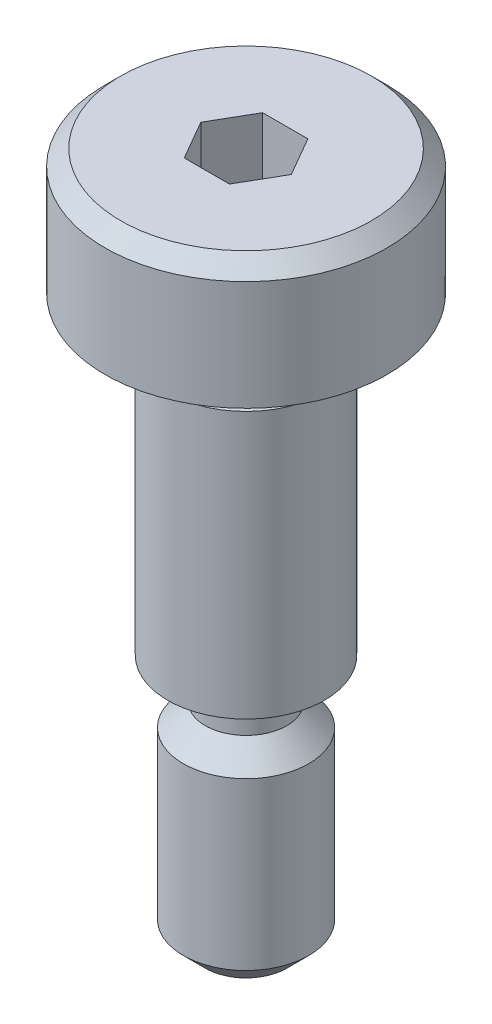
ISO-10303-21;
HEADER;
FILE_DESCRIPTION(('STEP AP214'),'2;1');
FILE_NAME('part.step','',(''),(''),'','','');
FILE_SCHEMA(('AUTOMOTIVE_DESIGN { 1 0 10303 214 1 1 1 1 }'));
ENDSEC;
DATA;
#1=APPLICATION_CONTEXT('core data for automotive mechanical design processes');
#2=APPLICATION_PROTOCOL_DEFINITION('international standard','automotive_design',2000,#1);
#3=PRODUCT_CONTEXT('',#1,'mechanical');
#4=PRODUCT('Part','Part','',(#3));
#5=PRODUCT_RELATED_PRODUCT_CATEGORY('part','',(#4));
#6=PRODUCT_DEFINITION_FORMATION('','',#4);
#7=PRODUCT_DEFINITION_CONTEXT('part definition',#1,'design');
#8=PRODUCT_DEFINITION('design','',#6,#7);
#9=PRODUCT_DEFINITION_SHAPE('','',#8);
#10=(LENGTH_UNIT() NAMED_UNIT(*) SI_UNIT(.MILLI.,.METRE.));
#11=(NAMED_UNIT(*) PLANE_ANGLE_UNIT() SI_UNIT($,.RADIAN.));
#12=(NAMED_UNIT(*) SI_UNIT($,.STERADIAN.) SOLID_ANGLE_UNIT());
#13=UNCERTAINTY_MEASURE_WITH_UNIT(LENGTH_MEASURE(1.E-05),#10,'distance_accuracy_value','');
#14=(GEOMETRIC_REPRESENTATION_CONTEXT(3) GLOBAL_UNCERTAINTY_ASSIGNED_CONTEXT((#13)) GLOBAL_UNIT_ASSIGNED_CONTEXT((#10,
#11,#12)) REPRESENTATION_CONTEXT('',''));
#15=CARTESIAN_POINT('',(0.,0.,0.));
#16=DIRECTION('',(0.,0.,1.));
#17=DIRECTION('',(1.,0.,0.));
#18=AXIS2_PLACEMENT_3D('',#15,#16,#17);
#19=CARTESIAN_POINT('',(1.3,0.,0.));
#20=DIRECTION('',(0.,-1.,0.));
#21=DIRECTION('',(0.,0.,-1.));
#22=AXIS2_PLACEMENT_3D('',#19,#20,#21);
#23=PLANE('',#22);
#24=CARTESIAN_POINT('',(0.,0.,0.));
#25=DIRECTION('',(0.,-1.,0.));
#26=DIRECTION('',(0.,0.,-1.));
#27=AXIS2_PLACEMENT_3D('',#24,#25,#26);
#28=CIRCLE('',#27,1.3);
#29=CARTESIAN_POINT('',(0.,0.,-1.3));
#30=VERTEX_POINT('',#29);
#31=EDGE_CURVE('E11',#30,#30,#28,.T.);
#32=ORIENTED_EDGE('',*,*,#31,.T.);
#33=EDGE_LOOP('',(#32));
#34=FACE_BOUND('',#33,.T.);
#35=ADVANCED_FACE('F34',(#34),#23,.T.);
#36=CARTESIAN_POINT('',(0.,0.,0.));
#37=DIRECTION('',(0.,1.,0.));
#38=DIRECTION('',(0.,0.,1.));
#39=AXIS2_PLACEMENT_3D('',#36,#37,#38);
#40=CONICAL_SURFACE('',#39,1.3,0.78539816339745);
#41=CARTESIAN_POINT('',(0.,0.699999999999998,0.));
#42=DIRECTION('',(0.,-1.,0.));
#43=DIRECTION('',(0.,0.,-1.));
#44=AXIS2_PLACEMENT_3D('',#41,#42,#43);
#45=CIRCLE('',#44,2.);
#46=CARTESIAN_POINT('',(0.,0.699999999999998,-2.));
#47=VERTEX_POINT('',#46);
#48=EDGE_CURVE('E41',#47,#47,#45,.T.);
#49=ORIENTED_EDGE('',*,*,#48,.T.);
#50=EDGE_LOOP('',(#49));
#51=FACE_BOUND('',#50,.T.);
#52=ORIENTED_EDGE('',*,*,#31,.F.);
#53=EDGE_LOOP('',(#52));
#54=FACE_BOUND('',#53,.T.);
#55=ADVANCED_FACE('F178',(#51,#54),#40,.T.);
#56=CARTESIAN_POINT('',(0.,0.,0.));
#57=DIRECTION('',(0.,-1.,0.));
#58=DIRECTION('',(0.,0.,-1.));
#59=AXIS2_PLACEMENT_3D('',#56,#57,#58);
#60=CYLINDRICAL_SURFACE('',#59,2.);
#61=CARTESIAN_POINT('',(0.,6.,0.));
#62=DIRECTION('',(0.,-1.,0.));
#63=DIRECTION('',(0.,0.,-1.));
#64=AXIS2_PLACEMENT_3D('',#61,#62,#63);
#65=CIRCLE('',#64,2.);
#66=CARTESIAN_POINT('',(0.,6.,-2.));
#67=VERTEX_POINT('',#66);
#68=EDGE_CURVE('E173',#67,#67,#65,.T.);
#69=ORIENTED_EDGE('',*,*,#68,.T.);
#70=EDGE_LOOP('',(#69));
#71=FACE_BOUND('',#70,.T.);
#72=ORIENTED_EDGE('',*,*,#48,.F.);
#73=EDGE_LOOP('',(#72));
#74=FACE_BOUND('',#73,.T.);
#75=ADVANCED_FACE('F181',(#71,#74),#60,.T.);
#76=CARTESIAN_POINT('',(0.,6.,0.));
#77=DIRECTION('',(0.,-1.,0.));
#78=DIRECTION('',(0.,0.,-1.));
#79=AXIS2_PLACEMENT_3D('',#76,#77,#78);
#80=CONICAL_SURFACE('',#79,2.,0.785398163397447);
#81=CARTESIAN_POINT('',(0.,6.7,0.));
#82=DIRECTION('',(0.,-1.,0.));
#83=DIRECTION('',(0.,0.,-1.));
#84=AXIS2_PLACEMENT_3D('',#81,#82,#83);
#85=CIRCLE('',#84,1.3);
#86=CARTESIAN_POINT('',(0.,6.7,-1.3));
#87=VERTEX_POINT('',#86);
#88=EDGE_CURVE('E170',#87,#87,#85,.T.);
#89=ORIENTED_EDGE('',*,*,#88,.T.);
#90=EDGE_LOOP('',(#89));
#91=FACE_BOUND('',#90,.T.);
#92=ORIENTED_EDGE('',*,*,#68,.F.);
#93=EDGE_LOOP('',(#92));
#94=FACE_BOUND('',#93,.T.);
#95=ADVANCED_FACE('F183',(#91,#94),#80,.T.);
#96=CARTESIAN_POINT('',(0.,0.,0.));
#97=DIRECTION('',(0.,-1.,0.));
#98=DIRECTION('',(0.,0.,-1.));
#99=AXIS2_PLACEMENT_3D('',#96,#97,#98);
#100=CYLINDRICAL_SURFACE('',#99,1.3);
#101=CARTESIAN_POINT('',(0.,7.3,0.));
#102=DIRECTION('',(0.,-1.,0.));
#103=DIRECTION('',(0.,0.,-1.));
#104=AXIS2_PLACEMENT_3D('',#101,#102,#103);
#105=CIRCLE('',#104,1.3);
#106=CARTESIAN_POINT('',(0.,7.3,-1.3));
#107=VERTEX_POINT('',#106);
#108=EDGE_CURVE('E167',#107,#107,#105,.T.);
#109=ORIENTED_EDGE('',*,*,#108,.T.);
#110=EDGE_LOOP('',(#109));
#111=FACE_BOUND('',#110,.T.);
#112=ORIENTED_EDGE('',*,*,#88,.F.);
#113=EDGE_LOOP('',(#112));
#114=FACE_BOUND('',#113,.T.);
#115=ADVANCED_FACE('F190',(#111,#114),#100,.T.);
#116=CARTESIAN_POINT('',(0.,7.3,0.));
#117=DIRECTION('',(0.,-1.,0.));
#118=DIRECTION('',(0.,0.,-1.));
#119=AXIS2_PLACEMENT_3D('',#116,#117,#118);
#120=TOROIDAL_SURFACE('',#119,2.,0.700000000000001);
#121=CARTESIAN_POINT('',(0.,8.,0.));
#122=DIRECTION('',(0.,-1.,0.));
#123=DIRECTION('',(0.,0.,-1.));
#124=AXIS2_PLACEMENT_3D('',#121,#122,#123);
#125=CIRCLE('',#124,2.);
#126=CARTESIAN_POINT('',(0.,8.,-2.));
#127=VERTEX_POINT('',#126);
#128=EDGE_CURVE('E164',#127,#127,#125,.T.);
#129=ORIENTED_EDGE('',*,*,#128,.T.);
#130=EDGE_LOOP('',(#129));
#131=FACE_BOUND('',#130,.T.);
#132=ORIENTED_EDGE('',*,*,#108,.F.);
#133=EDGE_LOOP('',(#132));
#134=FACE_BOUND('',#133,.T.);
#135=ADVANCED_FACE('F221',(#131,#134),#120,.F.);
#136=CARTESIAN_POINT('',(2.5,8.,0.));
#137=DIRECTION('',(0.,-1.,0.));
#138=DIRECTION('',(0.,0.,-1.));
#139=AXIS2_PLACEMENT_3D('',#136,#137,#138);
#140=PLANE('',#139);
#141=CARTESIAN_POINT('',(0.,8.,0.));
#142=DIRECTION('',(0.,-1.,0.));
#143=DIRECTION('',(0.,0.,-1.));
#144=AXIS2_PLACEMENT_3D('',#141,#142,#143);
#145=CIRCLE('',#144,2.5);
#146=CARTESIAN_POINT('',(0.,8.,-2.5));
#147=VERTEX_POINT('',#146);
#148=EDGE_CURVE('E161',#147,#147,#145,.T.);
#149=ORIENTED_EDGE('',*,*,#148,.T.);
#150=EDGE_LOOP('',(#149));
#151=FACE_BOUND('',#150,.T.);
#152=ORIENTED_EDGE('',*,*,#128,.F.);
#153=EDGE_LOOP('',(#152));
#154=FACE_BOUND('',#153,.T.);
#155=ADVANCED_FACE('F231',(#151,#154),#140,.T.);
#156=CARTESIAN_POINT('',(0.,0.,0.));
#157=DIRECTION('',(0.,-1.,0.));
#158=DIRECTION('',(0.,0.,-1.));
#159=AXIS2_PLACEMENT_3D('',#156,#157,#158);
#160=CYLINDRICAL_SURFACE('',#159,2.5);
#161=CARTESIAN_POINT('',(0.,16.5,0.));
#162=DIRECTION('',(0.,-1.,0.));
#163=DIRECTION('',(0.,0.,-1.));
#164=AXIS2_PLACEMENT_3D('',#161,#162,#163);
#165=CIRCLE('',#164,2.5);
#166=CARTESIAN_POINT('',(0.,16.5,-2.5));
#167=VERTEX_POINT('',#166);
#168=EDGE_CURVE('E158',#167,#167,#165,.T.);
#169=ORIENTED_EDGE('',*,*,#168,.T.);
#170=EDGE_LOOP('',(#169));
#171=FACE_BOUND('',#170,.T.);
#172=ORIENTED_EDGE('',*,*,#148,.F.);
#173=EDGE_LOOP('',(#172));
#174=FACE_BOUND('',#173,.T.);
#175=ADVANCED_FACE('F241',(#171,#174),#160,.T.);
#176=CARTESIAN_POINT('',(0.,16.5,0.));
#177=DIRECTION('',(0.,-1.,0.));
#178=DIRECTION('',(0.,0.,-1.));
#179=AXIS2_PLACEMENT_3D('',#176,#177,#178);
#180=CONICAL_SURFACE('',#179,2.5,0.785398163397445);
#181=CARTESIAN_POINT('',(0.,17.,0.));
#182=DIRECTION('',(0.,-1.,0.));
#183=DIRECTION('',(0.,0.,-1.));
#184=AXIS2_PLACEMENT_3D('',#181,#182,#183);
#185=CIRCLE('',#184,2.);
#186=CARTESIAN_POINT('',(0.,17.,-2.));
#187=VERTEX_POINT('',#186);
#188=EDGE_CURVE('E155',#187,#187,#185,.T.);
#189=ORIENTED_EDGE('',*,*,#188,.T.);
#190=EDGE_LOOP('',(#189));
#191=FACE_BOUND('',#190,.T.);
#192=ORIENTED_EDGE('',*,*,#168,.F.);
#193=EDGE_LOOP('',(#192));
#194=FACE_BOUND('',#193,.T.);
#195=ADVANCED_FACE('F251',(#191,#194),#180,.T.);
#196=CARTESIAN_POINT('',(0.,0.,0.));
#197=DIRECTION('',(0.,-1.,0.));
#198=DIRECTION('',(0.,0.,-1.));
#199=AXIS2_PLACEMENT_3D('',#196,#197,#198);
#200=CYLINDRICAL_SURFACE('',#199,2.);
#201=CARTESIAN_POINT('',(0.,17.5,0.));
#202=DIRECTION('',(0.,-1.,0.));
#203=DIRECTION('',(0.,0.,-1.));
#204=AXIS2_PLACEMENT_3D('',#201,#202,#203);
#205=CIRCLE('',#204,2.);
#206=CARTESIAN_POINT('',(0.,17.5,-2.));
#207=VERTEX_POINT('',#206);
#208=EDGE_CURVE('E152',#207,#207,#205,.T.);
#209=ORIENTED_EDGE('',*,*,#208,.T.);
#210=EDGE_LOOP('',(#209));
#211=FACE_BOUND('',#210,.T.);
#212=ORIENTED_EDGE('',*,*,#188,.F.);
#213=EDGE_LOOP('',(#212));
#214=FACE_BOUND('',#213,.T.);
#215=ADVANCED_FACE('F261',(#211,#214),#200,.T.);
#216=CARTESIAN_POINT('',(0.,17.5,0.));
#217=DIRECTION('',(0.,-1.,0.));
#218=DIRECTION('',(0.,0.,-1.));
#219=AXIS2_PLACEMENT_3D('',#216,#217,#218);
#220=TOROIDAL_SURFACE('',#219,2.5,0.5);
#221=CARTESIAN_POINT('',(0.,18.,0.));
#222=DIRECTION('',(0.,-1.,0.));
#223=DIRECTION('',(0.,0.,-1.));
#224=AXIS2_PLACEMENT_3D('',#221,#222,#223);
#225=CIRCLE('',#224,2.5);
#226=CARTESIAN_POINT('',(0.,18.,-2.5));
#227=VERTEX_POINT('',#226);
#228=EDGE_CURVE('E149',#227,#227,#225,.T.);
#229=ORIENTED_EDGE('',*,*,#228,.T.);
#230=EDGE_LOOP('',(#229));
#231=FACE_BOUND('',#230,.T.);
#232=ORIENTED_EDGE('',*,*,#208,.F.);
#233=EDGE_LOOP('',(#232));
#234=FACE_BOUND('',#233,.T.);
#235=ADVANCED_FACE('F271',(#231,#234),#220,.F.);
#236=CARTESIAN_POINT('',(4.5,18.,0.));
#237=DIRECTION('',(0.,-1.,0.));
#238=DIRECTION('',(0.,0.,-1.));
#239=AXIS2_PLACEMENT_3D('',#236,#237,#238);
#240=PLANE('',#239);
#241=CARTESIAN_POINT('',(0.,18.,0.));
#242=DIRECTION('',(0.,-1.,0.));
#243=DIRECTION('',(0.,0.,-1.));
#244=AXIS2_PLACEMENT_3D('',#241,#242,#243);
#245=CIRCLE('',#244,4.5);
#246=CARTESIAN_POINT('',(0.,18.,-4.5));
#247=VERTEX_POINT('',#246);
#248=EDGE_CURVE('E146',#247,#247,#245,.T.);
#249=ORIENTED_EDGE('',*,*,#248,.T.);
#250=EDGE_LOOP('',(#249));
#251=FACE_BOUND('',#250,.T.);
#252=ORIENTED_EDGE('',*,*,#228,.F.);
#253=EDGE_LOOP('',(#252));
#254=FACE_BOUND('',#253,.T.);
#255=ADVANCED_FACE('F281',(#251,#254),#240,.T.);
#256=CARTESIAN_POINT('',(0.,0.,0.));
#257=DIRECTION('',(0.,-1.,0.));
#258=DIRECTION('',(0.,0.,-1.));
#259=AXIS2_PLACEMENT_3D('',#256,#257,#258);
#260=CYLINDRICAL_SURFACE('',#259,4.5);
#261=CARTESIAN_POINT('',(0.,21.5,0.));
#262=DIRECTION('',(0.,-1.,0.));
#263=DIRECTION('',(0.,0.,-1.));
#264=AXIS2_PLACEMENT_3D('',#261,#262,#263);
#265=CIRCLE('',#264,4.5);
#266=CARTESIAN_POINT('',(0.,21.5,-4.5));
#267=VERTEX_POINT('',#266);
#268=EDGE_CURVE('E143',#267,#267,#265,.T.);
#269=ORIENTED_EDGE('',*,*,#268,.T.);
#270=EDGE_LOOP('',(#269));
#271=FACE_BOUND('',#270,.T.);
#272=ORIENTED_EDGE('',*,*,#248,.F.);
#273=EDGE_LOOP('',(#272));
#274=FACE_BOUND('',#273,.T.);
#275=ADVANCED_FACE('F291',(#271,#274),#260,.T.);
#276=CARTESIAN_POINT('',(0.,21.5,0.));
#277=DIRECTION('',(0.,-1.,0.));
#278=DIRECTION('',(0.,0.,-1.));
#279=AXIS2_PLACEMENT_3D('',#276,#277,#278);
#280=CONICAL_SURFACE('',#279,4.5,0.785398163397446);
#281=CARTESIAN_POINT('',(0.,22.,0.));
#282=DIRECTION('',(0.,-1.,0.));
#283=DIRECTION('',(0.,0.,-1.));
#284=AXIS2_PLACEMENT_3D('',#281,#282,#283);
#285=CIRCLE('',#284,4.);
#286=CARTESIAN_POINT('',(0.,22.,-4.));
#287=VERTEX_POINT('',#286);
#288=EDGE_CURVE('E135',#287,#287,#285,.T.);
#289=ORIENTED_EDGE('',*,*,#288,.T.);
#290=EDGE_LOOP('',(#289));
#291=FACE_BOUND('',#290,.T.);
#292=ORIENTED_EDGE('',*,*,#268,.F.);
#293=EDGE_LOOP('',(#292));
#294=FACE_BOUND('',#293,.T.);
#295=ADVANCED_FACE('F301',(#291,#294),#280,.T.);
#296=CARTESIAN_POINT('',(0.,22.,0.));
#297=DIRECTION('',(0.,1.,0.));
#298=DIRECTION('',(0.,0.,1.));
#299=AXIS2_PLACEMENT_3D('',#296,#297,#298);
#300=PLANE('',#299);
#301=DIRECTION('',(-0.5,0.,-0.866025403784438));
#302=VECTOR('',#301,1.);
#303=CARTESIAN_POINT('',(1.44337567297406,22.,0.));
#304=LINE('',#303,#302);
#305=CARTESIAN_POINT('',(1.44337567297406,22.,0.));
#306=VERTEX_POINT('',#305);
#307=CARTESIAN_POINT('',(0.721687836487032,22.,-1.25));
#308=VERTEX_POINT('',#307);
#309=EDGE_CURVE('E48',#306,#308,#304,.T.);
#310=ORIENTED_EDGE('',*,*,#309,.F.);
#311=DIRECTION('',(0.5,0.,-0.866025403784438));
#312=VECTOR('',#311,1.);
#313=CARTESIAN_POINT('',(0.721687836487032,22.,1.25));
#314=LINE('',#313,#312);
#315=CARTESIAN_POINT('',(0.721687836487032,22.,1.25));
#316=VERTEX_POINT('',#315);
#317=EDGE_CURVE('E131',#316,#306,#314,.T.);
#318=ORIENTED_EDGE('',*,*,#317,.F.);
#319=DIRECTION('',(1.,0.,0.));
#320=VECTOR('',#319,1.);
#321=CARTESIAN_POINT('',(-0.721687836487032,22.,1.25));
#322=LINE('',#321,#320);
#323=CARTESIAN_POINT('',(-0.721687836487032,22.,1.25));
#324=VERTEX_POINT('',#323);
#325=EDGE_CURVE('E129',#324,#316,#322,.T.);
#326=ORIENTED_EDGE('',*,*,#325,.F.);
#327=DIRECTION('',(0.5,0.,0.866025403784439));
#328=VECTOR('',#327,1.);
#329=CARTESIAN_POINT('',(-1.44337567297406,22.,0.));
#330=LINE('',#329,#328);
#331=CARTESIAN_POINT('',(-1.44337567297406,22.,0.));
#332=VERTEX_POINT('',#331);
#333=EDGE_CURVE('E96',#332,#324,#330,.T.);
#334=ORIENTED_EDGE('',*,*,#333,.F.);
#335=DIRECTION('',(-0.5,0.,0.866025403784439));
#336=VECTOR('',#335,1.);
#337=CARTESIAN_POINT('',(-0.721687836487032,22.,-1.25));
#338=LINE('',#337,#336);
#339=CARTESIAN_POINT('',(-0.721687836487032,22.,-1.25));
#340=VERTEX_POINT('',#339);
#341=EDGE_CURVE('E125',#340,#332,#338,.T.);
#342=ORIENTED_EDGE('',*,*,#341,.F.);
#343=DIRECTION('',(-1.,0.,0.));
#344=VECTOR('',#343,1.);
#345=CARTESIAN_POINT('',(0.721687836487032,22.,-1.25));
#346=LINE('',#345,#344);
#347=EDGE_CURVE('E122',#308,#340,#346,.T.);
#348=ORIENTED_EDGE('',*,*,#347,.F.);
#349=EDGE_LOOP('',(#310,#318,#326,#334,#342,#348));
#350=FACE_BOUND('',#349,.T.);
#351=ORIENTED_EDGE('',*,*,#288,.F.);
#352=EDGE_LOOP('',(#351));
#353=FACE_BOUND('',#352,.T.);
#354=ADVANCED_FACE('F311',(#350,#353),#300,.T.);
#355=CARTESIAN_POINT('',(1.44337567297406,19.,0.));
#356=DIRECTION('',(0.866025403784439,0.,-0.5));
#357=DIRECTION('',(-0.5,0.,-0.866025403784439));
#358=AXIS2_PLACEMENT_3D('',#355,#356,#357);
#359=PLANE('',#358);
#360=ORIENTED_EDGE('',*,*,#309,.T.);
#361=DIRECTION('',(0.,1.,0.));
#362=VECTOR('',#361,1.);
#363=CARTESIAN_POINT('',(0.721687836487032,19.,-1.25));
#364=LINE('',#363,#362);
#365=CARTESIAN_POINT('',(0.721687836487032,19.,-1.25));
#366=VERTEX_POINT('',#365);
#367=EDGE_CURVE('E78',#366,#308,#364,.T.);
#368=ORIENTED_EDGE('',*,*,#367,.F.);
#369=DIRECTION('',(-0.5,0.,-0.866025403784438));
#370=VECTOR('',#369,1.);
#371=CARTESIAN_POINT('',(1.44337567297406,19.,0.));
#372=LINE('',#371,#370);
#373=CARTESIAN_POINT('',(1.44337567297406,19.,0.));
#374=VERTEX_POINT('',#373);
#375=EDGE_CURVE('E133',#374,#366,#372,.T.);
#376=ORIENTED_EDGE('',*,*,#375,.F.);
#377=DIRECTION('',(0.,1.,0.));
#378=VECTOR('',#377,1.);
#379=CARTESIAN_POINT('',(1.44337567297406,19.,0.));
#380=LINE('',#379,#378);
#381=EDGE_CURVE('E56',#374,#306,#380,.T.);
#382=ORIENTED_EDGE('',*,*,#381,.T.);
#383=EDGE_LOOP('',(#360,#368,#376,#382));
#384=FACE_BOUND('',#383,.T.);
#385=ADVANCED_FACE('F321',(#384),#359,.F.);
#386=CARTESIAN_POINT('',(0.721687836487032,19.,1.25));
#387=DIRECTION('',(0.866025403784439,0.,0.5));
#388=DIRECTION('',(0.5,0.,-0.866025403784439));
#389=AXIS2_PLACEMENT_3D('',#386,#387,#388);
#390=PLANE('',#389);
#391=ORIENTED_EDGE('',*,*,#317,.T.);
#392=ORIENTED_EDGE('',*,*,#381,.F.);
#393=DIRECTION('',(0.5,0.,-0.866025403784438));
#394=VECTOR('',#393,1.);
#395=CARTESIAN_POINT('',(0.721687836487032,19.,1.25));
#396=LINE('',#395,#394);
#397=CARTESIAN_POINT('',(0.721687836487032,19.,1.25));
#398=VERTEX_POINT('',#397);
#399=EDGE_CURVE('E108',#398,#374,#396,.T.);
#400=ORIENTED_EDGE('',*,*,#399,.F.);
#401=DIRECTION('',(0.,1.,0.));
#402=VECTOR('',#401,1.);
#403=CARTESIAN_POINT('',(0.721687836487032,19.,1.25));
#404=LINE('',#403,#402);
#405=EDGE_CURVE('E100',#398,#316,#404,.T.);
#406=ORIENTED_EDGE('',*,*,#405,.T.);
#407=EDGE_LOOP('',(#391,#392,#400,#406));
#408=FACE_BOUND('',#407,.T.);
#409=ADVANCED_FACE('F331',(#408),#390,.F.);
#410=CARTESIAN_POINT('',(-0.721687836487032,19.,1.25));
#411=DIRECTION('',(0.,0.,1.));
#412=DIRECTION('',(1.,0.,0.));
#413=AXIS2_PLACEMENT_3D('',#410,#411,#412);
#414=PLANE('',#413);
#415=ORIENTED_EDGE('',*,*,#325,.T.);
#416=ORIENTED_EDGE('',*,*,#405,.F.);
#417=DIRECTION('',(1.,0.,0.));
#418=VECTOR('',#417,1.);
#419=CARTESIAN_POINT('',(-0.721687836487032,19.,1.25));
#420=LINE('',#419,#418);
#421=CARTESIAN_POINT('',(-0.721687836487032,19.,1.25));
#422=VERTEX_POINT('',#421);
#423=EDGE_CURVE('E104',#422,#398,#420,.T.);
#424=ORIENTED_EDGE('',*,*,#423,.F.);
#425=DIRECTION('',(0.,1.,0.));
#426=VECTOR('',#425,1.);
#427=CARTESIAN_POINT('',(-0.721687836487032,19.,1.25));
#428=LINE('',#427,#426);
#429=EDGE_CURVE('E89',#422,#324,#428,.T.);
#430=ORIENTED_EDGE('',*,*,#429,.T.);
#431=EDGE_LOOP('',(#415,#416,#424,#430));
#432=FACE_BOUND('',#431,.T.);
#433=ADVANCED_FACE('F105',(#432),#414,.F.);
#434=CARTESIAN_POINT('',(-1.44337567297406,19.,0.));
#435=DIRECTION('',(-0.866025403784438,0.,0.5));
#436=DIRECTION('',(0.5,0.,0.866025403784439));
#437=AXIS2_PLACEMENT_3D('',#434,#435,#436);
#438=PLANE('',#437);
#439=ORIENTED_EDGE('',*,*,#333,.T.);
#440=ORIENTED_EDGE('',*,*,#429,.F.);
#441=DIRECTION('',(0.5,0.,0.866025403784439));
#442=VECTOR('',#441,1.);
#443=CARTESIAN_POINT('',(-1.44337567297406,19.,0.));
#444=LINE('',#443,#442);
#445=CARTESIAN_POINT('',(-1.44337567297406,19.,0.));
#446=VERTEX_POINT('',#445);
#447=EDGE_CURVE('E93',#446,#422,#444,.T.);
#448=ORIENTED_EDGE('',*,*,#447,.F.);
#449=DIRECTION('',(0.,1.,0.));
#450=VECTOR('',#449,1.);
#451=CARTESIAN_POINT('',(-1.44337567297406,19.,0.));
#452=LINE('',#451,#450);
#453=EDGE_CURVE('E101',#446,#332,#452,.T.);
#454=ORIENTED_EDGE('',*,*,#453,.T.);
#455=EDGE_LOOP('',(#439,#440,#448,#454));
#456=FACE_BOUND('',#455,.T.);
#457=ADVANCED_FACE('F91',(#456),#438,.F.);
#458=CARTESIAN_POINT('',(-0.721687836487032,19.,-1.25));
#459=DIRECTION('',(-0.866025403784438,0.,-0.5));
#460=DIRECTION('',(-0.5,0.,0.866025403784439));
#461=AXIS2_PLACEMENT_3D('',#458,#459,#460);
#462=PLANE('',#461);
#463=ORIENTED_EDGE('',*,*,#341,.T.);
#464=ORIENTED_EDGE('',*,*,#453,.F.);
#465=DIRECTION('',(-0.5,0.,0.866025403784439));
#466=VECTOR('',#465,1.);
#467=CARTESIAN_POINT('',(-0.721687836487032,19.,-1.25));
#468=LINE('',#467,#466);
#469=CARTESIAN_POINT('',(-0.721687836487032,19.,-1.25));
#470=VERTEX_POINT('',#469);
#471=EDGE_CURVE('E114',#470,#446,#468,.T.);
#472=ORIENTED_EDGE('',*,*,#471,.F.);
#473=DIRECTION('',(0.,1.,0.));
#474=VECTOR('',#473,1.);
#475=CARTESIAN_POINT('',(-0.721687836487032,19.,-1.25));
#476=LINE('',#475,#474);
#477=EDGE_CURVE('E138',#470,#340,#476,.T.);
#478=ORIENTED_EDGE('',*,*,#477,.T.);
#479=EDGE_LOOP('',(#463,#464,#472,#478));
#480=FACE_BOUND('',#479,.T.);
#481=ADVANCED_FACE('F356',(#480),#462,.F.);
#482=CARTESIAN_POINT('',(0.721687836487032,19.,-1.25));
#483=DIRECTION('',(0.,0.,-1.));
#484=DIRECTION('',(-1.,0.,0.));
#485=AXIS2_PLACEMENT_3D('',#482,#483,#484);
#486=PLANE('',#485);
#487=ORIENTED_EDGE('',*,*,#347,.T.);
#488=ORIENTED_EDGE('',*,*,#477,.F.);
#489=DIRECTION('',(-1.,0.,0.));
#490=VECTOR('',#489,1.);
#491=CARTESIAN_POINT('',(0.721687836487032,19.,-1.25));
#492=LINE('',#491,#490);
#493=EDGE_CURVE('E116',#366,#470,#492,.T.);
#494=ORIENTED_EDGE('',*,*,#493,.F.);
#495=ORIENTED_EDGE('',*,*,#367,.T.);
#496=EDGE_LOOP('',(#487,#488,#494,#495));
#497=FACE_BOUND('',#496,.T.);
#498=ADVANCED_FACE('F365',(#497),#486,.F.);
#499=CARTESIAN_POINT('',(0.,19.,0.));
#500=DIRECTION('',(0.,1.,0.));
#501=DIRECTION('',(0.,0.,1.));
#502=AXIS2_PLACEMENT_3D('',#499,#500,#501);
#503=PLANE('',#502);
#504=ORIENTED_EDGE('',*,*,#375,.T.);
#505=ORIENTED_EDGE('',*,*,#493,.T.);
#506=ORIENTED_EDGE('',*,*,#471,.T.);
#507=ORIENTED_EDGE('',*,*,#447,.T.);
#508=ORIENTED_EDGE('',*,*,#423,.T.);
#509=ORIENTED_EDGE('',*,*,#399,.T.);
#510=EDGE_LOOP('',(#504,#505,#506,#507,#508,#509));
#511=FACE_BOUND('',#510,.T.);
#512=ADVANCED_FACE('F111',(#511),#503,.T.);
#513=CLOSED_SHELL('',(#35,#55,#75,#95,#115,#135,#155,#175,#195,#215,#235,#255,#275,#295,#354,
#385,#409,#433,#457,#481,#498,#512));
#514=MANIFOLD_SOLID_BREP('B2',#513);
#515=ADVANCED_BREP_SHAPE_REPRESENTATION('',(#18,#514),#14);
#516=SHAPE_DEFINITION_REPRESENTATION(#9,#515);
ENDSEC;
END-ISO-10303-21;
